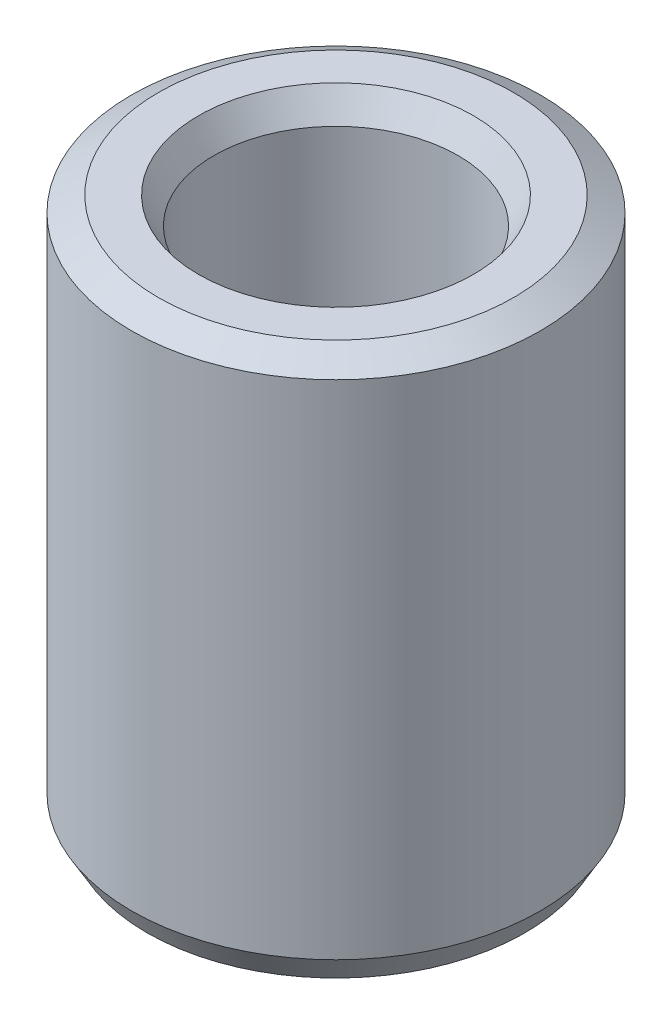
ISO-10303-21;
HEADER;
FILE_DESCRIPTION(('STEP AP214'),'2;1');
FILE_NAME('part.step','',(''),(''),'','','');
FILE_SCHEMA(('AUTOMOTIVE_DESIGN { 1 0 10303 214 1 1 1 1 }'));
ENDSEC;
DATA;
#1=APPLICATION_CONTEXT('core data for automotive mechanical design processes');
#2=APPLICATION_PROTOCOL_DEFINITION('international standard','automotive_design',2000,#1);
#3=PRODUCT_CONTEXT('',#1,'mechanical');
#4=PRODUCT('Part','Part','',(#3));
#5=PRODUCT_RELATED_PRODUCT_CATEGORY('part','',(#4));
#6=PRODUCT_DEFINITION_FORMATION('','',#4);
#7=PRODUCT_DEFINITION_CONTEXT('part definition',#1,'design');
#8=PRODUCT_DEFINITION('design','',#6,#7);
#9=PRODUCT_DEFINITION_SHAPE('','',#8);
#10=(LENGTH_UNIT() NAMED_UNIT(*) SI_UNIT(.MILLI.,.METRE.));
#11=(NAMED_UNIT(*) PLANE_ANGLE_UNIT() SI_UNIT($,.RADIAN.));
#12=(NAMED_UNIT(*) SI_UNIT($,.STERADIAN.) SOLID_ANGLE_UNIT());
#13=UNCERTAINTY_MEASURE_WITH_UNIT(LENGTH_MEASURE(1.E-05),#10,'distance_accuracy_value','');
#14=(GEOMETRIC_REPRESENTATION_CONTEXT(3) GLOBAL_UNCERTAINTY_ASSIGNED_CONTEXT((#13)) GLOBAL_UNIT_ASSIGNED_CONTEXT((#10,
#11,#12)) REPRESENTATION_CONTEXT('',''));
#15=CARTESIAN_POINT('',(0.,0.,0.));
#16=DIRECTION('',(0.,0.,1.));
#17=DIRECTION('',(1.,0.,0.));
#18=AXIS2_PLACEMENT_3D('',#15,#16,#17);
#19=CARTESIAN_POINT('',(0.,26.640486849517,0.));
#20=DIRECTION('',(0.,-1.,0.));
#21=DIRECTION('',(0.,0.,-1.));
#22=AXIS2_PLACEMENT_3D('',#19,#20,#21);
#23=CYLINDRICAL_SURFACE('',#22,10.);
#24=CARTESIAN_POINT('',(0.,1.30904944543526,0.));
#25=DIRECTION('',(0.,1.,0.));
#26=DIRECTION('',(0.,0.,1.));
#27=AXIS2_PLACEMENT_3D('',#24,#25,#26);
#28=CIRCLE('',#27,10.);
#29=CARTESIAN_POINT('',(0.,1.30904944543526,10.));
#30=VERTEX_POINT('',#29);
#31=EDGE_CURVE('E10',#30,#30,#28,.T.);
#32=ORIENTED_EDGE('',*,*,#31,.T.);
#33=EDGE_LOOP('',(#32));
#34=FACE_BOUND('',#33,.T.);
#35=CARTESIAN_POINT('',(0.,25.8847067998124,0.));
#36=DIRECTION('',(0.,1.,0.));
#37=DIRECTION('',(0.,0.,1.));
#38=AXIS2_PLACEMENT_3D('',#35,#36,#37);
#39=CIRCLE('',#38,10.);
#40=CARTESIAN_POINT('',(0.,25.8847067998124,10.));
#41=VERTEX_POINT('',#40);
#42=EDGE_CURVE('E50',#41,#41,#39,.F.);
#43=ORIENTED_EDGE('',*,*,#42,.T.);
#44=EDGE_LOOP('',(#43));
#45=FACE_BOUND('',#44,.T.);
#46=ADVANCED_FACE('F39',(#34,#45),#23,.T.);
#47=CARTESIAN_POINT('',(0.,26.640486849517,0.));
#48=DIRECTION('',(0.,1.,0.));
#49=DIRECTION('',(0.,0.,1.));
#50=AXIS2_PLACEMENT_3D('',#47,#48,#49);
#51=PLANE('',#50);
#52=CARTESIAN_POINT('',(0.,26.640486849517,0.));
#53=DIRECTION('',(0.,1.,0.));
#54=DIRECTION('',(0.,0.,1.));
#55=AXIS2_PLACEMENT_3D('',#52,#53,#54);
#56=CIRCLE('',#55,6.727627254478);
#57=CARTESIAN_POINT('',(0.,26.640486849517,6.727627254478));
#58=VERTEX_POINT('',#57);
#59=EDGE_CURVE('E58',#58,#58,#56,.F.);
#60=ORIENTED_EDGE('',*,*,#59,.T.);
#61=EDGE_LOOP('',(#60));
#62=FACE_BOUND('',#61,.T.);
#63=CARTESIAN_POINT('',(0.,26.640486849517,0.));
#64=DIRECTION('',(0.,1.,0.));
#65=DIRECTION('',(0.,0.,1.));
#66=AXIS2_PLACEMENT_3D('',#63,#64,#65);
#67=CIRCLE('',#66,8.69095055456472);
#68=CARTESIAN_POINT('',(0.,26.640486849517,8.69095055456472));
#69=VERTEX_POINT('',#68);
#70=EDGE_CURVE('E61',#69,#69,#67,.T.);
#71=ORIENTED_EDGE('',*,*,#70,.T.);
#72=EDGE_LOOP('',(#71));
#73=FACE_BOUND('',#72,.T.);
#74=ADVANCED_FACE('F88',(#62,#73),#51,.T.);
#75=CARTESIAN_POINT('',(0.,0.,0.));
#76=DIRECTION('',(0.,1.,0.));
#77=DIRECTION('',(0.,0.,1.));
#78=AXIS2_PLACEMENT_3D('',#75,#76,#77);
#79=PLANE('',#78);
#80=CARTESIAN_POINT('',(0.,0.,0.));
#81=DIRECTION('',(0.,1.,0.));
#82=DIRECTION('',(0.,0.,1.));
#83=AXIS2_PLACEMENT_3D('',#80,#81,#82);
#84=CIRCLE('',#83,7.28089665020869);
#85=CARTESIAN_POINT('',(0.,0.,7.28089665020869));
#86=VERTEX_POINT('',#85);
#87=EDGE_CURVE('E51',#86,#86,#84,.T.);
#88=ORIENTED_EDGE('',*,*,#87,.T.);
#89=EDGE_LOOP('',(#88));
#90=FACE_BOUND('',#89,.T.);
#91=CARTESIAN_POINT('',(0.,0.,0.));
#92=DIRECTION('',(0.,1.,0.));
#93=DIRECTION('',(0.,0.,1.));
#94=AXIS2_PLACEMENT_3D('',#91,#92,#93);
#95=CIRCLE('',#94,9.24421995029542);
#96=CARTESIAN_POINT('',(0.,0.,9.24421995029542));
#97=VERTEX_POINT('',#96);
#98=EDGE_CURVE('E54',#97,#97,#95,.F.);
#99=ORIENTED_EDGE('',*,*,#98,.T.);
#100=EDGE_LOOP('',(#99));
#101=FACE_BOUND('',#100,.T.);
#102=ADVANCED_FACE('F83',(#90,#101),#79,.F.);
#103=CARTESIAN_POINT('',(0.,26.640486849517,0.));
#104=DIRECTION('',(0.,-1.,0.));
#105=DIRECTION('',(0.,0.,-1.));
#106=AXIS2_PLACEMENT_3D('',#103,#104,#105);
#107=CYLINDRICAL_SURFACE('',#106,5.97184720477342);
#108=CARTESIAN_POINT('',(0.,25.3314374040817,0.));
#109=DIRECTION('',(0.,1.,0.));
#110=DIRECTION('',(0.,0.,1.));
#111=AXIS2_PLACEMENT_3D('',#108,#109,#110);
#112=CIRCLE('',#111,5.97184720477342);
#113=CARTESIAN_POINT('',(0.,25.3314374040817,5.97184720477342));
#114=VERTEX_POINT('',#113);
#115=EDGE_CURVE('E67',#114,#114,#112,.T.);
#116=ORIENTED_EDGE('',*,*,#115,.T.);
#117=EDGE_LOOP('',(#116));
#118=FACE_BOUND('',#117,.T.);
#119=CARTESIAN_POINT('',(0.,0.755780049704589,0.));
#120=DIRECTION('',(0.,1.,0.));
#121=DIRECTION('',(0.,0.,1.));
#122=AXIS2_PLACEMENT_3D('',#119,#120,#121);
#123=CIRCLE('',#122,5.97184720477342);
#124=CARTESIAN_POINT('',(0.,0.755780049704589,5.97184720477342));
#125=VERTEX_POINT('',#124);
#126=EDGE_CURVE('E69',#125,#125,#123,.F.);
#127=ORIENTED_EDGE('',*,*,#126,.T.);
#128=EDGE_LOOP('',(#127));
#129=FACE_BOUND('',#128,.T.);
#130=ADVANCED_FACE('F71',(#118,#129),#107,.F.);
#131=CARTESIAN_POINT('',(0.,25.3314374040817,0.));
#132=DIRECTION('',(0.,1.,0.));
#133=DIRECTION('',(0.,0.,1.));
#134=AXIS2_PLACEMENT_3D('',#131,#132,#133);
#135=CONICAL_SURFACE('',#134,5.97184720477342,0.523598775598304);
#136=ORIENTED_EDGE('',*,*,#59,.F.);
#137=EDGE_LOOP('',(#136));
#138=FACE_BOUND('',#137,.T.);
#139=ORIENTED_EDGE('',*,*,#115,.F.);
#140=EDGE_LOOP('',(#139));
#141=FACE_BOUND('',#140,.T.);
#142=ADVANCED_FACE('F77',(#138,#141),#135,.F.);
#143=CARTESIAN_POINT('',(0.,0.,0.));
#144=DIRECTION('',(0.,-1.,0.));
#145=DIRECTION('',(0.,0.,-1.));
#146=AXIS2_PLACEMENT_3D('',#143,#144,#145);
#147=CONICAL_SURFACE('',#146,7.28089665020869,1.0471975511966);
#148=ORIENTED_EDGE('',*,*,#126,.F.);
#149=EDGE_LOOP('',(#148));
#150=FACE_BOUND('',#149,.T.);
#151=ORIENTED_EDGE('',*,*,#87,.F.);
#152=EDGE_LOOP('',(#151));
#153=FACE_BOUND('',#152,.T.);
#154=ADVANCED_FACE('F73',(#150,#153),#147,.F.);
#155=CARTESIAN_POINT('',(0.,1.30904944543526,0.));
#156=DIRECTION('',(0.,1.,0.));
#157=DIRECTION('',(0.,0.,1.));
#158=AXIS2_PLACEMENT_3D('',#155,#156,#157);
#159=CONICAL_SURFACE('',#158,10.,0.523598775598302);
#160=ORIENTED_EDGE('',*,*,#98,.F.);
#161=EDGE_LOOP('',(#160));
#162=FACE_BOUND('',#161,.T.);
#163=ORIENTED_EDGE('',*,*,#31,.F.);
#164=EDGE_LOOP('',(#163));
#165=FACE_BOUND('',#164,.T.);
#166=ADVANCED_FACE('F76',(#162,#165),#159,.T.);
#167=CARTESIAN_POINT('',(0.,26.640486849517,0.));
#168=DIRECTION('',(0.,-1.,0.));
#169=DIRECTION('',(0.,0.,-1.));
#170=AXIS2_PLACEMENT_3D('',#167,#168,#169);
#171=CONICAL_SURFACE('',#170,8.69095055456472,1.04719755119659);
#172=ORIENTED_EDGE('',*,*,#42,.F.);
#173=EDGE_LOOP('',(#172));
#174=FACE_BOUND('',#173,.T.);
#175=ORIENTED_EDGE('',*,*,#70,.F.);
#176=EDGE_LOOP('',(#175));
#177=FACE_BOUND('',#176,.T.);
#178=ADVANCED_FACE('F45',(#174,#177),#171,.T.);
#179=CLOSED_SHELL('',(#46,#74,#102,#130,#142,#154,#166,#178));
#180=MANIFOLD_SOLID_BREP('B2',#179);
#181=ADVANCED_BREP_SHAPE_REPRESENTATION('',(#18,#180),#14);
#182=SHAPE_DEFINITION_REPRESENTATION(#9,#181);
ENDSEC;
END-ISO-10303-21;
